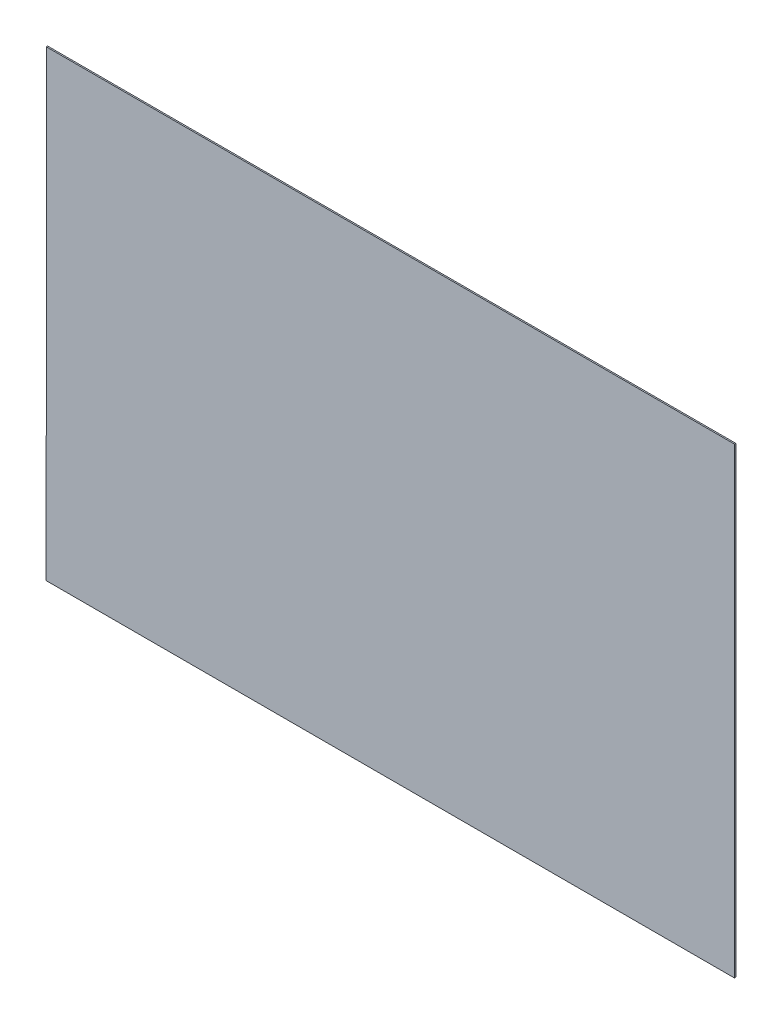
ISO-10303-21;
HEADER;
FILE_DESCRIPTION(('STEP AP214'),'2;1');
FILE_NAME('part.step','',(''),(''),'','','');
FILE_SCHEMA(('AUTOMOTIVE_DESIGN { 1 0 10303 214 1 1 1 1 }'));
ENDSEC;
DATA;
#1=APPLICATION_CONTEXT('core data for automotive mechanical design processes');
#2=APPLICATION_PROTOCOL_DEFINITION('international standard','automotive_design',2000,#1);
#3=PRODUCT_CONTEXT('',#1,'mechanical');
#4=PRODUCT('Part','Part','',(#3));
#5=PRODUCT_RELATED_PRODUCT_CATEGORY('part','',(#4));
#6=PRODUCT_DEFINITION_FORMATION('','',#4);
#7=PRODUCT_DEFINITION_CONTEXT('part definition',#1,'design');
#8=PRODUCT_DEFINITION('design','',#6,#7);
#9=PRODUCT_DEFINITION_SHAPE('','',#8);
#10=(LENGTH_UNIT() NAMED_UNIT(*) SI_UNIT(.MILLI.,.METRE.));
#11=(NAMED_UNIT(*) PLANE_ANGLE_UNIT() SI_UNIT($,.RADIAN.));
#12=(NAMED_UNIT(*) SI_UNIT($,.STERADIAN.) SOLID_ANGLE_UNIT());
#13=UNCERTAINTY_MEASURE_WITH_UNIT(LENGTH_MEASURE(1.E-05),#10,'distance_accuracy_value','');
#14=(GEOMETRIC_REPRESENTATION_CONTEXT(3) GLOBAL_UNCERTAINTY_ASSIGNED_CONTEXT((#13)) GLOBAL_UNIT_ASSIGNED_CONTEXT((#10,
#11,#12)) REPRESENTATION_CONTEXT('',''));
#15=CARTESIAN_POINT('',(0.,0.,0.));
#16=DIRECTION('',(0.,0.,1.));
#17=DIRECTION('',(1.,0.,0.));
#18=AXIS2_PLACEMENT_3D('',#15,#16,#17);
#19=CARTESIAN_POINT('',(1.523888348175E-05,-4.344368329024E-06,0.00100076));
#20=DIRECTION('',(0.,0.,1.));
#21=DIRECTION('',(1.,0.,0.));
#22=AXIS2_PLACEMENT_3D('',#19,#20,#21);
#23=PLANE('',#22);
#24=DIRECTION('',(-0.999999999988082,-4.8823118664894E-06,0.));
#25=VECTOR('',#24,1.);
#26=CARTESIAN_POINT('',(0.26015188,0.17479518,0.00100076));
#27=LINE('',#26,#25);
#28=CARTESIAN_POINT('',(0.26015188,0.17479518,0.00100076));
#29=VERTEX_POINT('',#28);
#30=CARTESIAN_POINT('',(-0.26009346,0.17479264,0.00100076));
#31=VERTEX_POINT('',#30);
#32=EDGE_CURVE('E93',#29,#31,#27,.T.);
#33=ORIENTED_EDGE('',*,*,#32,.T.);
#34=DIRECTION('',(-0.000159846545245927,-0.999999987224541,0.));
#35=VECTOR('',#34,1.);
#36=CARTESIAN_POINT('',(-0.26009346,0.17479264,0.00100076));
#37=LINE('',#36,#35);
#38=CARTESIAN_POINT('',(-0.26014934,-0.17479264,0.00100076));
#39=VERTEX_POINT('',#38);
#40=EDGE_CURVE('E73',#31,#39,#37,.T.);
#41=ORIENTED_EDGE('',*,*,#40,.T.);
#42=DIRECTION('',(0.999999999988084,4.88178751631641E-06,0.));
#43=VECTOR('',#42,1.);
#44=CARTESIAN_POINT('',(-0.26014934,-0.17479264,0.00100076));
#45=LINE('',#44,#43);
#46=CARTESIAN_POINT('',(0.26015188,-0.1747901,0.00100076));
#47=VERTEX_POINT('',#46);
#48=EDGE_CURVE('E87',#39,#47,#45,.T.);
#49=ORIENTED_EDGE('',*,*,#48,.T.);
#50=DIRECTION('',(0.,1.,0.));
#51=VECTOR('',#50,1.);
#52=CARTESIAN_POINT('',(0.26015188,-0.1747901,0.00100076));
#53=LINE('',#52,#51);
#54=EDGE_CURVE('E11',#47,#29,#53,.T.);
#55=ORIENTED_EDGE('',*,*,#54,.T.);
#56=EDGE_LOOP('',(#33,#41,#49,#55));
#57=FACE_BOUND('',#56,.T.);
#58=ADVANCED_FACE('F17',(#57),#23,.T.);
#59=CARTESIAN_POINT('',(1.523888348175E-05,-4.344368329024E-06,0.));
#60=DIRECTION('',(0.,0.,1.));
#61=DIRECTION('',(1.,0.,0.));
#62=AXIS2_PLACEMENT_3D('',#59,#60,#61);
#63=PLANE('',#62);
#64=DIRECTION('',(0.,1.,0.));
#65=VECTOR('',#64,1.);
#66=CARTESIAN_POINT('',(0.26015188,-0.1747901,0.));
#67=LINE('',#66,#65);
#68=CARTESIAN_POINT('',(0.26015188,-0.1747901,0.));
#69=VERTEX_POINT('',#68);
#70=CARTESIAN_POINT('',(0.26015188,0.17479518,0.));
#71=VERTEX_POINT('',#70);
#72=EDGE_CURVE('E26',#69,#71,#67,.T.);
#73=ORIENTED_EDGE('',*,*,#72,.F.);
#74=DIRECTION('',(0.999999999988084,4.88178751631641E-06,0.));
#75=VECTOR('',#74,1.);
#76=CARTESIAN_POINT('',(-0.26014934,-0.17479264,0.));
#77=LINE('',#76,#75);
#78=CARTESIAN_POINT('',(-0.26014934,-0.17479264,0.));
#79=VERTEX_POINT('',#78);
#80=EDGE_CURVE('E58',#79,#69,#77,.T.);
#81=ORIENTED_EDGE('',*,*,#80,.F.);
#82=DIRECTION('',(-0.000159846545245927,-0.999999987224541,0.));
#83=VECTOR('',#82,1.);
#84=CARTESIAN_POINT('',(-0.26009346,0.17479264,0.));
#85=LINE('',#84,#83);
#86=CARTESIAN_POINT('',(-0.26009346,0.17479264,0.));
#87=VERTEX_POINT('',#86);
#88=EDGE_CURVE('E95',#87,#79,#85,.T.);
#89=ORIENTED_EDGE('',*,*,#88,.F.);
#90=DIRECTION('',(-0.999999999988082,-4.8823118664894E-06,0.));
#91=VECTOR('',#90,1.);
#92=CARTESIAN_POINT('',(0.26015188,0.17479518,0.));
#93=LINE('',#92,#91);
#94=EDGE_CURVE('E92',#71,#87,#93,.T.);
#95=ORIENTED_EDGE('',*,*,#94,.F.);
#96=EDGE_LOOP('',(#73,#81,#89,#95));
#97=FACE_BOUND('',#96,.T.);
#98=ADVANCED_FACE('F19',(#97),#63,.F.);
#99=CARTESIAN_POINT('',(0.26015188,-0.1747901,0.));
#100=DIRECTION('',(-1.,0.,0.));
#101=DIRECTION('',(0.,0.,1.));
#102=AXIS2_PLACEMENT_3D('',#99,#100,#101);
#103=PLANE('',#102);
#104=ORIENTED_EDGE('',*,*,#72,.T.);
#105=DIRECTION('',(0.,0.,1.));
#106=VECTOR('',#105,1.);
#107=CARTESIAN_POINT('',(0.26015188,0.17479518,0.));
#108=LINE('',#107,#106);
#109=EDGE_CURVE('E82',#71,#29,#108,.T.);
#110=ORIENTED_EDGE('',*,*,#109,.T.);
#111=ORIENTED_EDGE('',*,*,#54,.F.);
#112=DIRECTION('',(0.,0.,1.));
#113=VECTOR('',#112,1.);
#114=CARTESIAN_POINT('',(0.26015188,-0.1747901,0.));
#115=LINE('',#114,#113);
#116=EDGE_CURVE('E85',#69,#47,#115,.T.);
#117=ORIENTED_EDGE('',*,*,#116,.F.);
#118=EDGE_LOOP('',(#104,#110,#111,#117));
#119=FACE_BOUND('',#118,.T.);
#120=ADVANCED_FACE('F81',(#119),#103,.F.);
#121=CARTESIAN_POINT('',(-0.26014934,-0.17479264,0.));
#122=DIRECTION('',(-4.88178751631641E-06,0.999999999988084,0.));
#123=DIRECTION('',(0.,0.,1.));
#124=AXIS2_PLACEMENT_3D('',#121,#122,#123);
#125=PLANE('',#124);
#126=ORIENTED_EDGE('',*,*,#80,.T.);
#127=ORIENTED_EDGE('',*,*,#116,.T.);
#128=ORIENTED_EDGE('',*,*,#48,.F.);
#129=DIRECTION('',(0.,0.,1.));
#130=VECTOR('',#129,1.);
#131=CARTESIAN_POINT('',(-0.26014934,-0.17479264,0.));
#132=LINE('',#131,#130);
#133=EDGE_CURVE('E108',#79,#39,#132,.T.);
#134=ORIENTED_EDGE('',*,*,#133,.F.);
#135=EDGE_LOOP('',(#126,#127,#128,#134));
#136=FACE_BOUND('',#135,.T.);
#137=ADVANCED_FACE('F121',(#136),#125,.F.);
#138=CARTESIAN_POINT('',(-0.26009346,0.17479264,0.));
#139=DIRECTION('',(0.999999987224541,-0.000159846545245927,0.));
#140=DIRECTION('',(0.,0.,-1.));
#141=AXIS2_PLACEMENT_3D('',#138,#139,#140);
#142=PLANE('',#141);
#143=ORIENTED_EDGE('',*,*,#88,.T.);
#144=ORIENTED_EDGE('',*,*,#133,.T.);
#145=ORIENTED_EDGE('',*,*,#40,.F.);
#146=DIRECTION('',(0.,0.,1.));
#147=VECTOR('',#146,1.);
#148=CARTESIAN_POINT('',(-0.26009346,0.17479264,0.));
#149=LINE('',#148,#147);
#150=EDGE_CURVE('E99',#87,#31,#149,.T.);
#151=ORIENTED_EDGE('',*,*,#150,.F.);
#152=EDGE_LOOP('',(#143,#144,#145,#151));
#153=FACE_BOUND('',#152,.T.);
#154=ADVANCED_FACE('F122',(#153),#142,.F.);
#155=CARTESIAN_POINT('',(0.26015188,0.17479518,0.));
#156=DIRECTION('',(4.8823118664894E-06,-0.999999999988082,0.));
#157=DIRECTION('',(0.,0.,-1.));
#158=AXIS2_PLACEMENT_3D('',#155,#156,#157);
#159=PLANE('',#158);
#160=ORIENTED_EDGE('',*,*,#94,.T.);
#161=ORIENTED_EDGE('',*,*,#150,.T.);
#162=ORIENTED_EDGE('',*,*,#32,.F.);
#163=ORIENTED_EDGE('',*,*,#109,.F.);
#164=EDGE_LOOP('',(#160,#161,#162,#163));
#165=FACE_BOUND('',#164,.T.);
#166=ADVANCED_FACE('F90',(#165),#159,.F.);
#167=CLOSED_SHELL('',(#58,#98,#120,#137,#154,#166));
#168=MANIFOLD_SOLID_BREP('B1',#167);
#169=ADVANCED_BREP_SHAPE_REPRESENTATION('',(#18,#168),#14);
#170=SHAPE_DEFINITION_REPRESENTATION(#9,#169);
ENDSEC;
END-ISO-10303-21;
